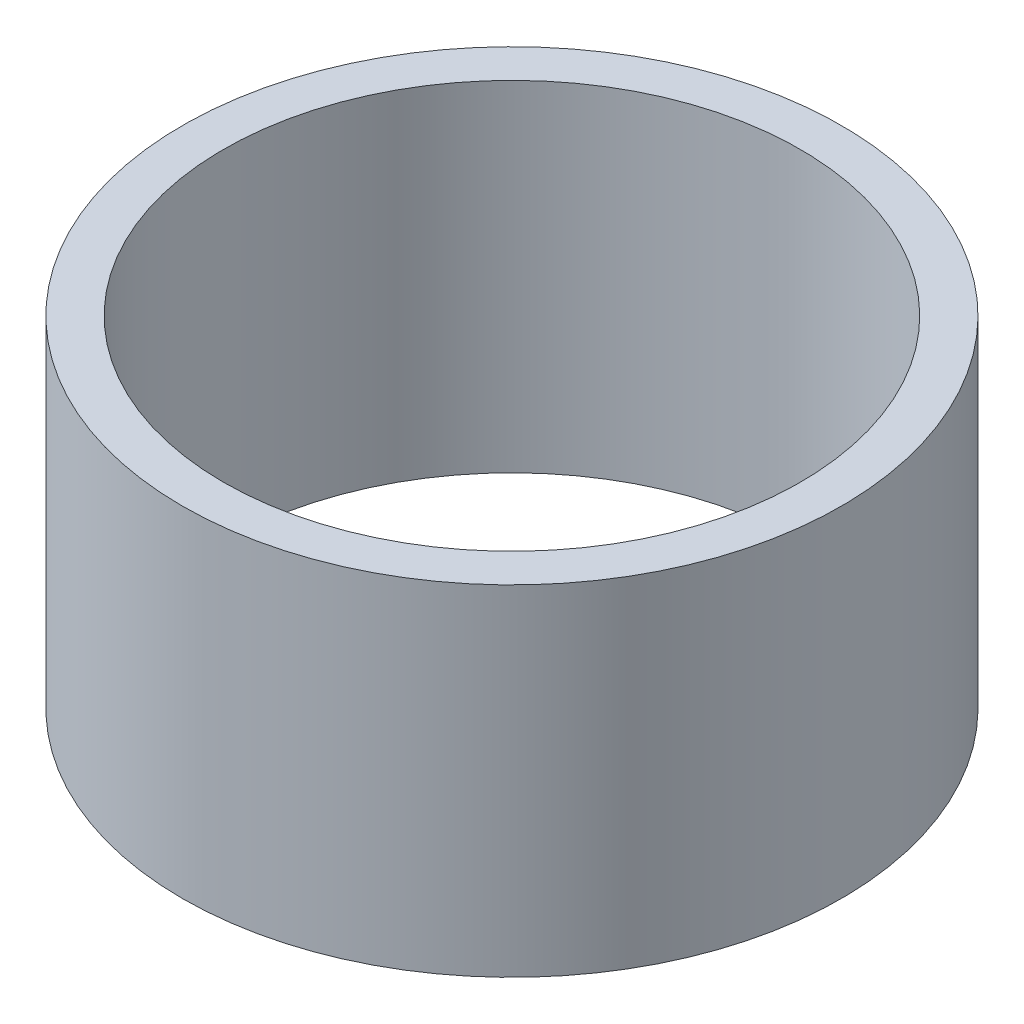
ISO-10303-21;
HEADER;
FILE_DESCRIPTION(('STEP AP214'),'2;1');
FILE_NAME('part.step','',(''),(''),'','','');
FILE_SCHEMA(('AUTOMOTIVE_DESIGN { 1 0 10303 214 1 1 1 1 }'));
ENDSEC;
DATA;
#1=APPLICATION_CONTEXT('core data for automotive mechanical design processes');
#2=APPLICATION_PROTOCOL_DEFINITION('international standard','automotive_design',2000,#1);
#3=PRODUCT_CONTEXT('',#1,'mechanical');
#4=PRODUCT('Part','Part','',(#3));
#5=PRODUCT_RELATED_PRODUCT_CATEGORY('part','',(#4));
#6=PRODUCT_DEFINITION_FORMATION('','',#4);
#7=PRODUCT_DEFINITION_CONTEXT('part definition',#1,'design');
#8=PRODUCT_DEFINITION('design','',#6,#7);
#9=PRODUCT_DEFINITION_SHAPE('','',#8);
#10=(LENGTH_UNIT() NAMED_UNIT(*) SI_UNIT(.MILLI.,.METRE.));
#11=(NAMED_UNIT(*) PLANE_ANGLE_UNIT() SI_UNIT($,.RADIAN.));
#12=(NAMED_UNIT(*) SI_UNIT($,.STERADIAN.) SOLID_ANGLE_UNIT());
#13=UNCERTAINTY_MEASURE_WITH_UNIT(LENGTH_MEASURE(1.E-05),#10,'distance_accuracy_value','');
#14=(GEOMETRIC_REPRESENTATION_CONTEXT(3) GLOBAL_UNCERTAINTY_ASSIGNED_CONTEXT((#13)) GLOBAL_UNIT_ASSIGNED_CONTEXT((#10,
#11,#12)) REPRESENTATION_CONTEXT('',''));
#15=CARTESIAN_POINT('',(0.,0.,0.));
#16=DIRECTION('',(0.,0.,1.));
#17=DIRECTION('',(1.,0.,0.));
#18=AXIS2_PLACEMENT_3D('',#15,#16,#17);
#19=CARTESIAN_POINT('',(0.,33.,0.));
#20=DIRECTION('',(0.,1.,0.));
#21=DIRECTION('',(0.,0.,1.));
#22=AXIS2_PLACEMENT_3D('',#19,#20,#21);
#23=PLANE('',#22);
#24=CARTESIAN_POINT('',(0.,33.,0.));
#25=DIRECTION('',(0.,1.,0.));
#26=DIRECTION('',(0.,0.,1.));
#27=AXIS2_PLACEMENT_3D('',#24,#25,#26);
#28=CIRCLE('',#27,32.);
#29=CARTESIAN_POINT('',(0.,33.,32.));
#30=VERTEX_POINT('',#29);
#31=EDGE_CURVE('E10',#30,#30,#28,.T.);
#32=ORIENTED_EDGE('',*,*,#31,.T.);
#33=EDGE_LOOP('',(#32));
#34=FACE_BOUND('',#33,.T.);
#35=CARTESIAN_POINT('',(0.,33.,0.));
#36=DIRECTION('',(0.,1.,0.));
#37=DIRECTION('',(0.,0.,1.));
#38=AXIS2_PLACEMENT_3D('',#35,#36,#37);
#39=CIRCLE('',#38,28.);
#40=CARTESIAN_POINT('',(0.,33.,28.));
#41=VERTEX_POINT('',#40);
#42=EDGE_CURVE('E43',#41,#41,#39,.T.);
#43=ORIENTED_EDGE('',*,*,#42,.F.);
#44=EDGE_LOOP('',(#43));
#45=FACE_BOUND('',#44,.T.);
#46=ADVANCED_FACE('F32',(#34,#45),#23,.T.);
#47=CARTESIAN_POINT('',(0.,0.,0.));
#48=DIRECTION('',(0.,1.,0.));
#49=DIRECTION('',(0.,0.,1.));
#50=AXIS2_PLACEMENT_3D('',#47,#48,#49);
#51=PLANE('',#50);
#52=CARTESIAN_POINT('',(0.,0.,0.));
#53=DIRECTION('',(0.,1.,0.));
#54=DIRECTION('',(0.,0.,1.));
#55=AXIS2_PLACEMENT_3D('',#52,#53,#54);
#56=CIRCLE('',#55,32.);
#57=CARTESIAN_POINT('',(0.,0.,32.));
#58=VERTEX_POINT('',#57);
#59=EDGE_CURVE('E36',#58,#58,#56,.T.);
#60=ORIENTED_EDGE('',*,*,#59,.F.);
#61=EDGE_LOOP('',(#60));
#62=FACE_BOUND('',#61,.T.);
#63=CARTESIAN_POINT('',(0.,0.,0.));
#64=DIRECTION('',(0.,1.,0.));
#65=DIRECTION('',(0.,0.,1.));
#66=AXIS2_PLACEMENT_3D('',#63,#64,#65);
#67=CIRCLE('',#66,28.);
#68=CARTESIAN_POINT('',(0.,0.,28.));
#69=VERTEX_POINT('',#68);
#70=EDGE_CURVE('E45',#69,#69,#67,.T.);
#71=ORIENTED_EDGE('',*,*,#70,.T.);
#72=EDGE_LOOP('',(#71));
#73=FACE_BOUND('',#72,.T.);
#74=ADVANCED_FACE('F55',(#62,#73),#51,.F.);
#75=CARTESIAN_POINT('',(0.,33.,0.));
#76=DIRECTION('',(0.,-1.,0.));
#77=DIRECTION('',(0.,0.,-1.));
#78=AXIS2_PLACEMENT_3D('',#75,#76,#77);
#79=CYLINDRICAL_SURFACE('',#78,32.);
#80=ORIENTED_EDGE('',*,*,#31,.F.);
#81=EDGE_LOOP('',(#80));
#82=FACE_BOUND('',#81,.T.);
#83=ORIENTED_EDGE('',*,*,#59,.T.);
#84=EDGE_LOOP('',(#83));
#85=FACE_BOUND('',#84,.T.);
#86=ADVANCED_FACE('F34',(#82,#85),#79,.T.);
#87=CARTESIAN_POINT('',(0.,33.,0.));
#88=DIRECTION('',(0.,-1.,0.));
#89=DIRECTION('',(0.,0.,-1.));
#90=AXIS2_PLACEMENT_3D('',#87,#88,#89);
#91=CYLINDRICAL_SURFACE('',#90,28.);
#92=ORIENTED_EDGE('',*,*,#42,.T.);
#93=EDGE_LOOP('',(#92));
#94=FACE_BOUND('',#93,.T.);
#95=ORIENTED_EDGE('',*,*,#70,.F.);
#96=EDGE_LOOP('',(#95));
#97=FACE_BOUND('',#96,.T.);
#98=ADVANCED_FACE('F51',(#94,#97),#91,.F.);
#99=CLOSED_SHELL('',(#46,#74,#86,#98));
#100=MANIFOLD_SOLID_BREP('B2',#99);
#101=ADVANCED_BREP_SHAPE_REPRESENTATION('',(#18,#100),#14);
#102=SHAPE_DEFINITION_REPRESENTATION(#9,#101);
ENDSEC;
END-ISO-10303-21;
